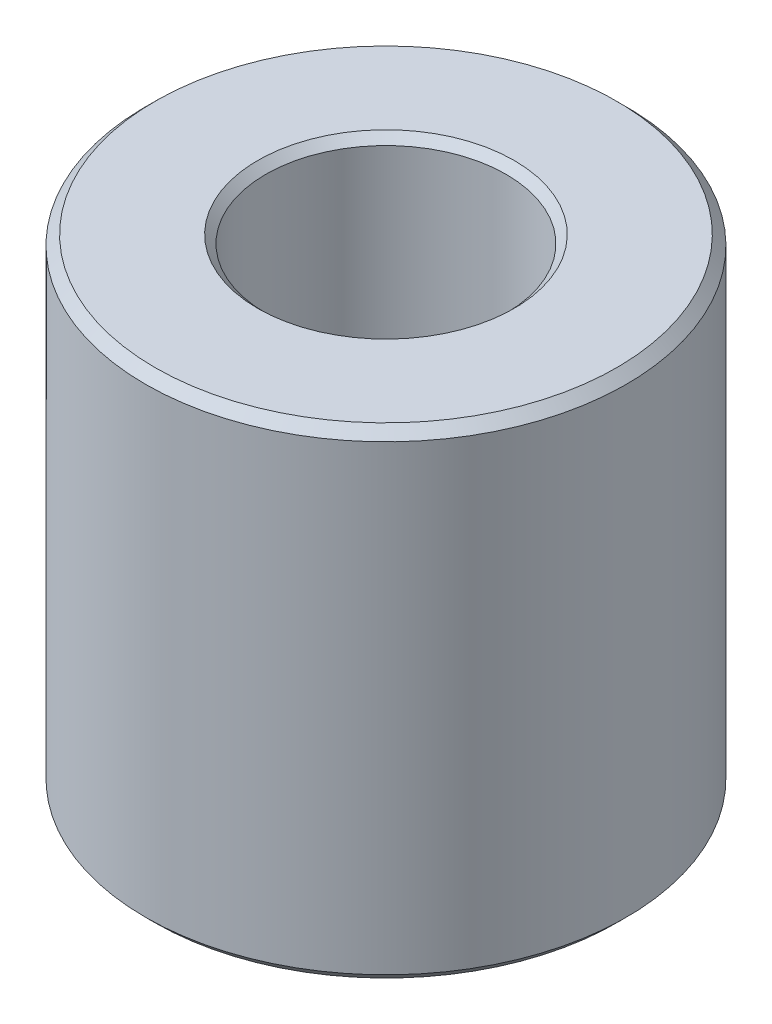
ISO-10303-21;
HEADER;
FILE_DESCRIPTION(('STEP AP214'),'2;1');
FILE_NAME('part.step','',(''),(''),'','','');
FILE_SCHEMA(('AUTOMOTIVE_DESIGN { 1 0 10303 214 1 1 1 1 }'));
ENDSEC;
DATA;
#1=APPLICATION_CONTEXT('core data for automotive mechanical design processes');
#2=APPLICATION_PROTOCOL_DEFINITION('international standard','automotive_design',2000,#1);
#3=PRODUCT_CONTEXT('',#1,'mechanical');
#4=PRODUCT('Part','Part','',(#3));
#5=PRODUCT_RELATED_PRODUCT_CATEGORY('part','',(#4));
#6=PRODUCT_DEFINITION_FORMATION('','',#4);
#7=PRODUCT_DEFINITION_CONTEXT('part definition',#1,'design');
#8=PRODUCT_DEFINITION('design','',#6,#7);
#9=PRODUCT_DEFINITION_SHAPE('','',#8);
#10=(LENGTH_UNIT() NAMED_UNIT(*) SI_UNIT(.MILLI.,.METRE.));
#11=(NAMED_UNIT(*) PLANE_ANGLE_UNIT() SI_UNIT($,.RADIAN.));
#12=(NAMED_UNIT(*) SI_UNIT($,.STERADIAN.) SOLID_ANGLE_UNIT());
#13=UNCERTAINTY_MEASURE_WITH_UNIT(LENGTH_MEASURE(1.E-05),#10,'distance_accuracy_value','');
#14=(GEOMETRIC_REPRESENTATION_CONTEXT(3) GLOBAL_UNCERTAINTY_ASSIGNED_CONTEXT((#13)) GLOBAL_UNIT_ASSIGNED_CONTEXT((#10,
#11,#12)) REPRESENTATION_CONTEXT('',''));
#15=CARTESIAN_POINT('',(0.,0.,0.));
#16=DIRECTION('',(0.,0.,1.));
#17=DIRECTION('',(1.,0.,0.));
#18=AXIS2_PLACEMENT_3D('',#15,#16,#17);
#19=CARTESIAN_POINT('',(0.,38.1,0.));
#20=DIRECTION('',(0.,-1.,0.));
#21=DIRECTION('',(0.,0.,-1.));
#22=AXIS2_PLACEMENT_3D('',#19,#20,#21);
#23=CYLINDRICAL_SURFACE('',#22,19.05);
#24=CARTESIAN_POINT('',(0.,0.76200000000002,0.));
#25=DIRECTION('',(0.,1.,0.));
#26=DIRECTION('',(0.,0.,1.));
#27=AXIS2_PLACEMENT_3D('',#24,#25,#26);
#28=CIRCLE('',#27,19.05);
#29=CARTESIAN_POINT('',(0.,0.76200000000002,19.05));
#30=VERTEX_POINT('',#29);
#31=EDGE_CURVE('E43',#30,#30,#28,.T.);
#32=ORIENTED_EDGE('',*,*,#31,.T.);
#33=EDGE_LOOP('',(#32));
#34=FACE_BOUND('',#33,.T.);
#35=CARTESIAN_POINT('',(0.,37.338,0.));
#36=DIRECTION('',(0.,1.,0.));
#37=DIRECTION('',(0.,0.,1.));
#38=AXIS2_PLACEMENT_3D('',#35,#36,#37);
#39=CIRCLE('',#38,19.05);
#40=CARTESIAN_POINT('',(0.,37.338,19.05));
#41=VERTEX_POINT('',#40);
#42=EDGE_CURVE('E47',#41,#41,#39,.F.);
#43=ORIENTED_EDGE('',*,*,#42,.T.);
#44=EDGE_LOOP('',(#43));
#45=FACE_BOUND('',#44,.T.);
#46=ADVANCED_FACE('F32',(#34,#45),#23,.T.);
#47=CARTESIAN_POINT('',(0.,38.1,0.));
#48=DIRECTION('',(0.,1.,0.));
#49=DIRECTION('',(0.,0.,1.));
#50=AXIS2_PLACEMENT_3D('',#47,#48,#49);
#51=PLANE('',#50);
#52=CARTESIAN_POINT('',(0.,38.1,0.));
#53=DIRECTION('',(0.,1.,0.));
#54=DIRECTION('',(0.,0.,1.));
#55=AXIS2_PLACEMENT_3D('',#52,#53,#54);
#56=CIRCLE('',#55,18.288);
#57=CARTESIAN_POINT('',(0.,38.1,18.288));
#58=VERTEX_POINT('',#57);
#59=EDGE_CURVE('E10',#58,#58,#56,.T.);
#60=ORIENTED_EDGE('',*,*,#59,.T.);
#61=EDGE_LOOP('',(#60));
#62=FACE_BOUND('',#61,.T.);
#63=CARTESIAN_POINT('',(0.,38.1,0.));
#64=DIRECTION('',(0.,1.,0.));
#65=DIRECTION('',(0.,0.,1.));
#66=AXIS2_PLACEMENT_3D('',#63,#64,#65);
#67=CIRCLE('',#66,10.16);
#68=CARTESIAN_POINT('',(0.,38.1,10.16));
#69=VERTEX_POINT('',#68);
#70=EDGE_CURVE('E52',#69,#69,#67,.T.);
#71=ORIENTED_EDGE('',*,*,#70,.F.);
#72=EDGE_LOOP('',(#71));
#73=FACE_BOUND('',#72,.T.);
#74=ADVANCED_FACE('F86',(#62,#73),#51,.T.);
#75=CARTESIAN_POINT('',(0.,0.,0.));
#76=DIRECTION('',(0.,1.,0.));
#77=DIRECTION('',(0.,0.,1.));
#78=AXIS2_PLACEMENT_3D('',#75,#76,#77);
#79=PLANE('',#78);
#80=CARTESIAN_POINT('',(0.,0.,0.));
#81=DIRECTION('',(0.,1.,0.));
#82=DIRECTION('',(0.,0.,1.));
#83=AXIS2_PLACEMENT_3D('',#80,#81,#82);
#84=CIRCLE('',#83,18.288);
#85=CARTESIAN_POINT('',(0.,0.,18.288));
#86=VERTEX_POINT('',#85);
#87=EDGE_CURVE('E39',#86,#86,#84,.F.);
#88=ORIENTED_EDGE('',*,*,#87,.T.);
#89=EDGE_LOOP('',(#88));
#90=FACE_BOUND('',#89,.T.);
#91=CARTESIAN_POINT('',(0.,0.,0.));
#92=DIRECTION('',(0.,1.,0.));
#93=DIRECTION('',(0.,0.,1.));
#94=AXIS2_PLACEMENT_3D('',#91,#92,#93);
#95=CIRCLE('',#94,10.16);
#96=CARTESIAN_POINT('',(0.,0.,10.16));
#97=VERTEX_POINT('',#96);
#98=EDGE_CURVE('E61',#97,#97,#95,.T.);
#99=ORIENTED_EDGE('',*,*,#98,.T.);
#100=EDGE_LOOP('',(#99));
#101=FACE_BOUND('',#100,.T.);
#102=ADVANCED_FACE('F65',(#90,#101),#79,.F.);
#103=CARTESIAN_POINT('',(0.,38.1,0.));
#104=DIRECTION('',(0.,1.,0.));
#105=DIRECTION('',(0.,0.,1.));
#106=AXIS2_PLACEMENT_3D('',#103,#104,#105);
#107=CONICAL_SURFACE('',#106,10.16,0.78539816339745);
#108=CARTESIAN_POINT('',(0.,37.465,0.));
#109=DIRECTION('',(0.,1.,0.));
#110=DIRECTION('',(0.,0.,1.));
#111=AXIS2_PLACEMENT_3D('',#108,#109,#110);
#112=CIRCLE('',#111,9.525);
#113=CARTESIAN_POINT('',(0.,37.465,9.525));
#114=VERTEX_POINT('',#113);
#115=EDGE_CURVE('E55',#114,#114,#112,.T.);
#116=ORIENTED_EDGE('',*,*,#115,.F.);
#117=EDGE_LOOP('',(#116));
#118=FACE_BOUND('',#117,.T.);
#119=ORIENTED_EDGE('',*,*,#70,.T.);
#120=EDGE_LOOP('',(#119));
#121=FACE_BOUND('',#120,.T.);
#122=ADVANCED_FACE('F77',(#118,#121),#107,.F.);
#123=CARTESIAN_POINT('',(0.,38.1,0.));
#124=DIRECTION('',(0.,1.,0.));
#125=DIRECTION('',(0.,0.,1.));
#126=AXIS2_PLACEMENT_3D('',#123,#124,#125);
#127=CYLINDRICAL_SURFACE('',#126,9.52499999999999);
#128=CARTESIAN_POINT('',(0.,0.635000000000011,0.));
#129=DIRECTION('',(0.,1.,0.));
#130=DIRECTION('',(0.,0.,1.));
#131=AXIS2_PLACEMENT_3D('',#128,#129,#130);
#132=CIRCLE('',#131,9.52499999999999);
#133=CARTESIAN_POINT('',(0.,0.635000000000011,9.52499999999999));
#134=VERTEX_POINT('',#133);
#135=EDGE_CURVE('E58',#134,#134,#132,.T.);
#136=ORIENTED_EDGE('',*,*,#135,.F.);
#137=EDGE_LOOP('',(#136));
#138=FACE_BOUND('',#137,.T.);
#139=ORIENTED_EDGE('',*,*,#115,.T.);
#140=EDGE_LOOP('',(#139));
#141=FACE_BOUND('',#140,.T.);
#142=ADVANCED_FACE('F71',(#138,#141),#127,.F.);
#143=CARTESIAN_POINT('',(0.,0.635000000000011,0.));
#144=DIRECTION('',(0.,-1.,0.));
#145=DIRECTION('',(0.,0.,-1.));
#146=AXIS2_PLACEMENT_3D('',#143,#144,#145);
#147=CONICAL_SURFACE('',#146,9.52499999999999,0.785398163397448);
#148=ORIENTED_EDGE('',*,*,#98,.F.);
#149=EDGE_LOOP('',(#148));
#150=FACE_BOUND('',#149,.T.);
#151=ORIENTED_EDGE('',*,*,#135,.T.);
#152=EDGE_LOOP('',(#151));
#153=FACE_BOUND('',#152,.T.);
#154=ADVANCED_FACE('F67',(#150,#153),#147,.F.);
#155=CARTESIAN_POINT('',(0.,0.76200000000002,0.));
#156=DIRECTION('',(0.,1.,0.));
#157=DIRECTION('',(0.,0.,1.));
#158=AXIS2_PLACEMENT_3D('',#155,#156,#157);
#159=CONICAL_SURFACE('',#158,19.05,0.785398163397453);
#160=ORIENTED_EDGE('',*,*,#87,.F.);
#161=EDGE_LOOP('',(#160));
#162=FACE_BOUND('',#161,.T.);
#163=ORIENTED_EDGE('',*,*,#31,.F.);
#164=EDGE_LOOP('',(#163));
#165=FACE_BOUND('',#164,.T.);
#166=ADVANCED_FACE('F70',(#162,#165),#159,.T.);
#167=CARTESIAN_POINT('',(0.,38.1,0.));
#168=DIRECTION('',(0.,-1.,0.));
#169=DIRECTION('',(0.,0.,-1.));
#170=AXIS2_PLACEMENT_3D('',#167,#168,#169);
#171=CONICAL_SURFACE('',#170,18.288,0.785398163397444);
#172=ORIENTED_EDGE('',*,*,#42,.F.);
#173=EDGE_LOOP('',(#172));
#174=FACE_BOUND('',#173,.T.);
#175=ORIENTED_EDGE('',*,*,#59,.F.);
#176=EDGE_LOOP('',(#175));
#177=FACE_BOUND('',#176,.T.);
#178=ADVANCED_FACE('F34',(#174,#177),#171,.T.);
#179=CLOSED_SHELL('',(#46,#74,#102,#122,#142,#154,#166,#178));
#180=MANIFOLD_SOLID_BREP('B2',#179);
#181=ADVANCED_BREP_SHAPE_REPRESENTATION('',(#18,#180),#14);
#182=SHAPE_DEFINITION_REPRESENTATION(#9,#181);
ENDSEC;
END-ISO-10303-21;
